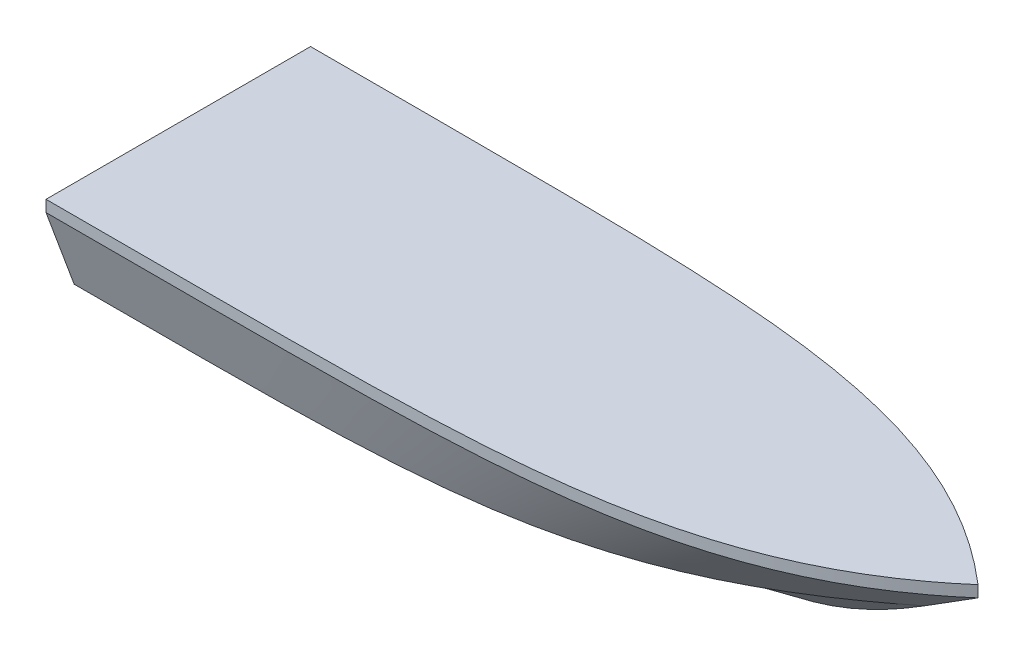
ISO-10303-21;
HEADER;
FILE_DESCRIPTION(('STEP AP214'),'2;1');
FILE_NAME('part.step','',(''),(''),'','','');
FILE_SCHEMA(('AUTOMOTIVE_DESIGN { 1 0 10303 214 1 1 1 1 }'));
ENDSEC;
DATA;
#1=APPLICATION_CONTEXT('core data for automotive mechanical design processes');
#2=APPLICATION_PROTOCOL_DEFINITION('international standard','automotive_design',2000,#1);
#3=PRODUCT_CONTEXT('',#1,'mechanical');
#4=PRODUCT('Part','Part','',(#3));
#5=PRODUCT_RELATED_PRODUCT_CATEGORY('part','',(#4));
#6=PRODUCT_DEFINITION_FORMATION('','',#4);
#7=PRODUCT_DEFINITION_CONTEXT('part definition',#1,'design');
#8=PRODUCT_DEFINITION('design','',#6,#7);
#9=PRODUCT_DEFINITION_SHAPE('','',#8);
#10=(LENGTH_UNIT() NAMED_UNIT(*) SI_UNIT(.MILLI.,.METRE.));
#11=(NAMED_UNIT(*) PLANE_ANGLE_UNIT() SI_UNIT($,.RADIAN.));
#12=(NAMED_UNIT(*) SI_UNIT($,.STERADIAN.) SOLID_ANGLE_UNIT());
#13=UNCERTAINTY_MEASURE_WITH_UNIT(LENGTH_MEASURE(1.E-05),#10,'distance_accuracy_value','');
#14=(GEOMETRIC_REPRESENTATION_CONTEXT(3) GLOBAL_UNCERTAINTY_ASSIGNED_CONTEXT((#13)) GLOBAL_UNIT_ASSIGNED_CONTEXT((#10,
#11,#12)) REPRESENTATION_CONTEXT('',''));
#15=CARTESIAN_POINT('',(0.,0.,0.));
#16=DIRECTION('',(0.,0.,1.));
#17=DIRECTION('',(1.,0.,0.));
#18=AXIS2_PLACEMENT_3D('',#15,#16,#17);
#19=CARTESIAN_POINT('',(3139.26827334746,1146.63157847919,146.348282725462));
#20=CARTESIAN_POINT('',(3318.28667634897,1146.63157847919,146.348282725462));
#21=CARTESIAN_POINT('',(3497.30507935048,1146.63157847919,146.348282725462));
#22=CARTESIAN_POINT('',(3676.32348235199,1146.63157847919,146.348282725462));
#23=CARTESIAN_POINT('',(3855.3418853535,1146.63157847919,146.348282725462));
#24=CARTESIAN_POINT('',(4023.95027334746,1146.63157847919,0.0213547819710433));
#25=B_SPLINE_CURVE_WITH_KNOTS('',5,(#19,#20,#21,#22,#23,#24),.UNSPECIFIED.,.F.,.F.,(6,6),(0.,
9710.49137354744),.UNSPECIFIED.);
#26=DIRECTION('',(0.,-1.,0.));
#27=VECTOR('',#26,1.);
#28=SURFACE_OF_LINEAR_EXTRUSION('',#25,#27);
#29=CARTESIAN_POINT('',(3139.26827334746,1133.93157847919,146.348282725462));
#30=CARTESIAN_POINT('',(3318.28667634897,1133.93157847919,146.348282725462));
#31=CARTESIAN_POINT('',(3497.30507935048,1133.93157847919,146.348282725462));
#32=CARTESIAN_POINT('',(3676.32348235199,1133.93157847919,146.348282725462));
#33=CARTESIAN_POINT('',(3855.3418853535,1133.93157847919,146.348282725462));
#34=CARTESIAN_POINT('',(4023.95027334746,1133.93157847919,0.0213547819710433));
#35=B_SPLINE_CURVE_WITH_KNOTS('',5,(#29,#30,#31,#32,#33,#34),.UNSPECIFIED.,.F.,.F.,(6,6),(0.,
9710.49137354744),.UNSPECIFIED.);
#36=CARTESIAN_POINT('',(3139.26827334746,1133.93157847919,146.348282725462));
#37=VERTEX_POINT('',#36);
#38=CARTESIAN_POINT('',(4023.95027334746,1133.93157847919,0.0213547819710433));
#39=VERTEX_POINT('',#38);
#40=EDGE_CURVE('E99',#37,#39,#35,.T.);
#41=ORIENTED_EDGE('',*,*,#40,.T.);
#42=DIRECTION('',(0.,-1.,0.));
#43=VECTOR('',#42,1.);
#44=CARTESIAN_POINT('',(4023.95027334746,1146.63157847919,0.0213547819710433));
#45=LINE('',#44,#43);
#46=CARTESIAN_POINT('',(4023.95027334746,1146.63157847919,0.0213547819710433));
#47=VERTEX_POINT('',#46);
#48=EDGE_CURVE('E12',#47,#39,#45,.T.);
#49=ORIENTED_EDGE('',*,*,#48,.F.);
#50=CARTESIAN_POINT('',(3139.26827334746,1146.63157847919,146.348282725462));
#51=VERTEX_POINT('',#50);
#52=EDGE_CURVE('E93',#51,#47,#25,.T.);
#53=ORIENTED_EDGE('',*,*,#52,.F.);
#54=DIRECTION('',(0.,-1.,0.));
#55=VECTOR('',#54,1.);
#56=CARTESIAN_POINT('',(3139.26827334746,1146.63157847919,146.348282725462));
#57=LINE('',#56,#55);
#58=EDGE_CURVE('E100',#51,#37,#57,.T.);
#59=ORIENTED_EDGE('',*,*,#58,.T.);
#60=EDGE_LOOP('',(#41,#49,#53,#59));
#61=FACE_BOUND('',#60,.T.);
#62=ADVANCED_FACE('F52',(#61),#28,.F.);
#63=CARTESIAN_POINT('',(4023.95027334746,1146.63157847919,0.0213547819710433));
#64=CARTESIAN_POINT('',(3855.3418853535,1146.63157847919,-146.30557316152));
#65=CARTESIAN_POINT('',(3676.32348235199,1146.63157847919,-146.30557316152));
#66=CARTESIAN_POINT('',(3497.30507935048,1146.63157847919,-146.30557316152));
#67=CARTESIAN_POINT('',(3318.28667634897,1146.63157847919,-146.30557316152));
#68=CARTESIAN_POINT('',(3139.26827334746,1146.63157847919,-146.30557316152));
#69=B_SPLINE_CURVE_WITH_KNOTS('',5,(#63,#64,#65,#66,#67,#68),.UNSPECIFIED.,.F.,.F.,(6,6),(0.,
9710.49137354744),.UNSPECIFIED.);
#70=DIRECTION('',(0.,-1.,0.));
#71=VECTOR('',#70,1.);
#72=SURFACE_OF_LINEAR_EXTRUSION('',#69,#71);
#73=CARTESIAN_POINT('',(4023.95027334746,1133.93157847919,0.0213547819710433));
#74=CARTESIAN_POINT('',(3855.3418853535,1133.93157847919,-146.30557316152));
#75=CARTESIAN_POINT('',(3676.32348235199,1133.93157847919,-146.30557316152));
#76=CARTESIAN_POINT('',(3497.30507935048,1133.93157847919,-146.30557316152));
#77=CARTESIAN_POINT('',(3318.28667634897,1133.93157847919,-146.30557316152));
#78=CARTESIAN_POINT('',(3139.26827334746,1133.93157847919,-146.30557316152));
#79=B_SPLINE_CURVE_WITH_KNOTS('',5,(#73,#74,#75,#76,#77,#78),.UNSPECIFIED.,.F.,.F.,(6,6),(0.,
9710.49137354744),.UNSPECIFIED.);
#80=CARTESIAN_POINT('',(3139.26827334746,1133.93157847919,-146.30557316152));
#81=VERTEX_POINT('',#80);
#82=EDGE_CURVE('E81',#39,#81,#79,.T.);
#83=ORIENTED_EDGE('',*,*,#82,.T.);
#84=DIRECTION('',(0.,-1.,0.));
#85=VECTOR('',#84,1.);
#86=CARTESIAN_POINT('',(3139.26827334746,1146.63157847919,-146.30557316152));
#87=LINE('',#86,#85);
#88=CARTESIAN_POINT('',(3139.26827334746,1146.63157847919,-146.30557316152));
#89=VERTEX_POINT('',#88);
#90=EDGE_CURVE('E61',#89,#81,#87,.T.);
#91=ORIENTED_EDGE('',*,*,#90,.F.);
#92=EDGE_CURVE('E89',#47,#89,#69,.T.);
#93=ORIENTED_EDGE('',*,*,#92,.F.);
#94=ORIENTED_EDGE('',*,*,#48,.T.);
#95=EDGE_LOOP('',(#83,#91,#93,#94));
#96=FACE_BOUND('',#95,.T.);
#97=ADVANCED_FACE('F90',(#96),#72,.F.);
#98=CARTESIAN_POINT('',(3139.26827334746,1146.63157847919,-146.30557316152));
#99=DIRECTION('',(1.,0.,0.));
#100=DIRECTION('',(0.,0.,-1.));
#101=AXIS2_PLACEMENT_3D('',#98,#99,#100);
#102=PLANE('',#101);
#103=DIRECTION('',(0.,0.,1.));
#104=VECTOR('',#103,1.);
#105=CARTESIAN_POINT('',(3139.26827334746,1133.93157847919,-146.30557316152));
#106=LINE('',#105,#104);
#107=EDGE_CURVE('E86',#81,#37,#106,.T.);
#108=ORIENTED_EDGE('',*,*,#107,.T.);
#109=ORIENTED_EDGE('',*,*,#58,.F.);
#110=DIRECTION('',(0.,0.,1.));
#111=VECTOR('',#110,1.);
#112=CARTESIAN_POINT('',(3139.26827334746,1146.63157847919,-146.30557316152));
#113=LINE('',#112,#111);
#114=EDGE_CURVE('E69',#89,#51,#113,.T.);
#115=ORIENTED_EDGE('',*,*,#114,.F.);
#116=ORIENTED_EDGE('',*,*,#90,.T.);
#117=EDGE_LOOP('',(#108,#109,#115,#116));
#118=FACE_BOUND('',#117,.T.);
#119=ADVANCED_FACE('F117',(#118),#102,.F.);
#120=CARTESIAN_POINT('',(3586.48896788225,1146.63157847919,141.775566227228));
#121=DIRECTION('',(0.,-1.,0.));
#122=DIRECTION('',(0.,0.,-1.));
#123=AXIS2_PLACEMENT_3D('',#120,#121,#122);
#124=PLANE('',#123);
#125=ORIENTED_EDGE('',*,*,#52,.T.);
#126=ORIENTED_EDGE('',*,*,#92,.T.);
#127=ORIENTED_EDGE('',*,*,#114,.T.);
#128=EDGE_LOOP('',(#125,#126,#127));
#129=FACE_BOUND('',#128,.T.);
#130=ADVANCED_FACE('F96',(#129),#124,.F.);
#131=CARTESIAN_POINT('',(3586.48896788225,1133.93157847919,141.775566227228));
#132=DIRECTION('',(0.,-1.,0.));
#133=DIRECTION('',(0.,0.,-1.));
#134=AXIS2_PLACEMENT_3D('',#131,#132,#133);
#135=PLANE('',#134);
#136=ORIENTED_EDGE('',*,*,#40,.F.);
#137=ORIENTED_EDGE('',*,*,#107,.F.);
#138=ORIENTED_EDGE('',*,*,#82,.F.);
#139=EDGE_LOOP('',(#136,#137,#138));
#140=FACE_BOUND('',#139,.T.);
#141=ADVANCED_FACE('F118',(#140),#135,.T.);
#142=CLOSED_SHELL('',(#62,#97,#119,#130,#141));
#143=MANIFOLD_SOLID_BREP('B2',#142);
#144=CARTESIAN_POINT('',(3139.26827334746,1022.4108319476,1.04505078197104));
#145=CARTESIAN_POINT('',(3139.26827334746,1022.68077847919,0.0213547819710433));
#146=CARTESIAN_POINT('',(3139.26827334746,1049.67543163806,-102.348245218029));
#147=CARTESIAN_POINT('',(3673.83207873831,1022.4108319476,1.04505078197104));
#148=CARTESIAN_POINT('',(3670.07747334746,1022.68077847919,0.0213547819710433));
#149=CARTESIAN_POINT('',(3294.61693426274,1049.67543163806,-102.348245218029));
#150=CARTESIAN_POINT('',(3731.84718012916,1022.4108319476,1.04505078197104));
#151=CARTESIAN_POINT('',(3729.05627334747,1022.68077847919,0.0213547819710433));
#152=CARTESIAN_POINT('',(3449.96559517802,1049.67543163806,-102.348245218029));
#153=CARTESIAN_POINT('',(3789.86228152,1022.4108319476,1.04505078197104));
#154=CARTESIAN_POINT('',(3788.03507334746,1022.68077847919,0.0213547819710433));
#155=CARTESIAN_POINT('',(3605.3142560933,1049.67543163806,-102.348245218029));
#156=CARTESIAN_POINT('',(3847.87738291085,1022.20707704899,1.04505078197104));
#157=CARTESIAN_POINT('',(3847.01387334747,1022.68077847919,0.0213547819710433));
#158=CARTESIAN_POINT('',(3760.66291700858,1070.05092149943,-102.348245218029));
#159=CARTESIAN_POINT('',(3964.97147334747,1096.84797847919,0.0213547819710433));
#160=CARTESIAN_POINT('',(3964.97147334747,1096.84797847919,0.0213547819710433));
#161=CARTESIAN_POINT('',(3964.97147334747,1096.84797847919,0.0213547819710433));
#162=B_SPLINE_SURFACE_WITH_KNOTS('',5,1,((#144,#145,#146),(#147,#148,#149),(#150,#151,#152),
(#153,#154,#155),(#156,#157,#158),(#159,#160,#161)),.UNSPECIFIED.,.F.,.F.,.F.,(6,6),(2,1,2),(0.,
8897.05627484771),(-12.7701332697109,0.,1277.01332697109),.UNSPECIFIED.);
#163=CARTESIAN_POINT('',(3215.46827334746,1029.37870628423,-25.3784536332029));
#164=CARTESIAN_POINT('',(3215.46827334746,1027.14606427228,-16.9118506726331));
#165=CARTESIAN_POINT('',(3215.46827334746,1024.91342226033,-8.44524771206329));
#166=CARTESIAN_POINT('',(3215.46827334746,1022.68078024839,0.0213552485065236));
#167=B_SPLINE_CURVE_WITH_KNOTS('',3,(#163,#164,#165,#166),.UNSPECIFIED.,.F.,.F.,(4,4),(0.,
26.2680890894068),.UNSPECIFIED.);
#168=CARTESIAN_POINT('',(3215.46827334747,1029.37865904841,-25.3784660893597));
#169=VERTEX_POINT('',#168);
#170=CARTESIAN_POINT('',(3215.46827334747,1022.68078024839,0.0213547819710485));
#171=VERTEX_POINT('',#170);
#172=EDGE_CURVE('E198',#169,#171,#167,.T.);
#173=CARTESIAN_POINT('',(3215.46827334733,1029.37875352069,-25.3786327617152));
#174=CARTESIAN_POINT('',(3212.45799471826,1029.37874514425,-25.3786335751318));
#175=CARTESIAN_POINT('',(3209.44771608918,1029.37873841474,-25.378634296887));
#176=CARTESIAN_POINT('',(3203.38142764437,1029.37872739207,-25.3786356185838));
#177=CARTESIAN_POINT('',(3200.32541782865,1029.37872313748,-25.3786362165081));
#178=CARTESIAN_POINT('',(3194.16700883229,1029.37871636365,-25.3786373389299));
#179=CARTESIAN_POINT('',(3191.06460965165,1029.37871387172,-25.378637862175));
#180=CARTESIAN_POINT('',(3184.8127574926,1029.37871008365,-25.3786388657521));
#181=CARTESIAN_POINT('',(3181.66330451419,1029.37870880621,-25.378639345313));
#182=CARTESIAN_POINT('',(3175.31667403759,1029.37870700142,-25.378640282987));
#183=CARTESIAN_POINT('',(3172.1194965394,1029.37870648573,-25.378640740665));
#184=CARTESIAN_POINT('',(3165.67673997742,1029.37870586893,-25.3786416472027));
#185=CARTESIAN_POINT('',(3162.43116091363,1029.37870577423,-25.3786420958239));
#186=CARTESIAN_POINT('',(3155.89091781627,1029.37870575674,-25.3786429908437));
#187=CARTESIAN_POINT('',(3152.5962537827,1029.37870583658,-25.3786434371061));
#188=CARTESIAN_POINT('',(3145.95715094857,1029.37870605102,-25.3786443291891));
#189=CARTESIAN_POINT('',(3142.61271214802,1029.37870618642,-25.3786447749012));
#190=CARTESIAN_POINT('',(3139.26827334746,1029.37870628427,-25.3786452180289));
#191=B_SPLINE_CURVE_WITH_KNOTS('',3,(#173,#174,#175,#176,#177,#178,#179,#180,#181,#182,#183,
#184,#185,#186,#187,#188,#189,#190),.UNSPECIFIED.,.F.,.F.,(4,2,2,2,2,2,2,2,4),(0.,
9.03083588726056,18.1988653344365,27.5060628763634,36.9544218115831,46.5459543061633,
56.2826914975235,66.1666835982499,76.1999999999051),.UNSPECIFIED.);
#192=CARTESIAN_POINT('',(3139.26827334746,1029.37870628427,-25.3786452180289));
#193=VERTEX_POINT('',#192);
#194=EDGE_CURVE('E50',#169,#193,#191,.T.);
#195=DIRECTION('',(0.,-0.254981645082517,0.96694589335237));
#196=VECTOR('',#195,1.);
#197=CARTESIAN_POINT('',(3139.26827334746,1049.67543163806,-102.348245218029));
#198=LINE('',#197,#196);
#199=CARTESIAN_POINT('',(3139.26827334746,1049.67543163806,-102.348245218029));
#200=VERTEX_POINT('',#199);
#201=EDGE_CURVE('E259',#200,#193,#198,.T.);
#202=CARTESIAN_POINT('',(3139.26827334746,1049.67543163806,-102.348245218029));
#203=CARTESIAN_POINT('',(3294.61693426274,1049.67543163806,-102.348245218029));
#204=CARTESIAN_POINT('',(3449.96559517802,1049.67543163806,-102.348245218029));
#205=CARTESIAN_POINT('',(3605.3142560933,1049.67543163806,-102.348245218029));
#206=CARTESIAN_POINT('',(3760.66291700858,1070.05092149943,-102.348245218029));
#207=CARTESIAN_POINT('',(3964.97147334747,1096.84797847919,0.0213547819710433));
#208=B_SPLINE_CURVE_WITH_KNOTS('',5,(#202,#203,#204,#205,#206,#207),.UNSPECIFIED.,.F.,.F.,(6,6),
(0.,8897.05627484771),.UNSPECIFIED.);
#209=CARTESIAN_POINT('',(3964.97147334747,1096.84797847919,0.0213547819710433));
#210=VERTEX_POINT('',#209);
#211=EDGE_CURVE('E249',#210,#200,#208,.F.);
#212=CARTESIAN_POINT('',(3139.26827334746,1022.68077847919,0.0213547819710433));
#213=CARTESIAN_POINT('',(3670.07747334746,1022.68077847919,0.0213547819710433));
#214=CARTESIAN_POINT('',(3729.05627334747,1022.68077847919,0.0213547819710433));
#215=CARTESIAN_POINT('',(3788.03507334746,1022.68077847919,0.0213547819710433));
#216=CARTESIAN_POINT('',(3847.01387334747,1022.68077847919,0.0213547819710433));
#217=CARTESIAN_POINT('',(3964.97147334747,1096.84797847919,0.0213547819710433));
#218=B_SPLINE_CURVE_WITH_KNOTS('',5,(#212,#213,#214,#215,#216,#217),.UNSPECIFIED.,.F.,.F.,(6,6),
(0.,8897.05627484771),.UNSPECIFIED.);
#219=EDGE_CURVE('E265',#171,#210,#218,.T.);
#220=ORIENTED_EDGE('',*,*,#172,.F.);
#221=ORIENTED_EDGE('',*,*,#194,.T.);
#222=ORIENTED_EDGE('',*,*,#201,.F.);
#223=ORIENTED_EDGE('',*,*,#211,.F.);
#224=ORIENTED_EDGE('',*,*,#219,.F.);
#225=EDGE_LOOP('',(#220,#221,#222,#223,#224));
#226=FACE_BOUND('',#225,.T.);
#227=ADVANCED_FACE('F181',(#226),#162,.F.);
#228=CARTESIAN_POINT('',(3139.26827334746,1022.68077847919,0.0213547819710433));
#229=DIRECTION('',(1.,0.,0.));
#230=DIRECTION('',(0.,0.,-1.));
#231=AXIS2_PLACEMENT_3D('',#228,#229,#230);
#232=PLANE('',#231);
#233=DIRECTION('',(0.,0.,1.));
#234=VECTOR('',#233,1.);
#235=CARTESIAN_POINT('',(3139.26827334746,1029.37870628427,-25.3786452180289));
#236=LINE('',#235,#234);
#237=CARTESIAN_POINT('',(3139.26827334746,1029.37870628427,25.4213547819711));
#238=VERTEX_POINT('',#237);
#239=EDGE_CURVE('E244',#193,#238,#236,.T.);
#240=ORIENTED_EDGE('',*,*,#239,.T.);
#241=DIRECTION('',(0.,-0.254981645082517,-0.96694589335237));
#242=VECTOR('',#241,1.);
#243=CARTESIAN_POINT('',(3139.26827334746,1049.67543163806,102.390954781971));
#244=LINE('',#243,#242);
#245=CARTESIAN_POINT('',(3139.26827334746,1049.67543163806,102.390954781971));
#246=VERTEX_POINT('',#245);
#247=EDGE_CURVE('E256',#246,#238,#244,.T.);
#248=ORIENTED_EDGE('',*,*,#247,.F.);
#249=DIRECTION('',(0.,0.,-1.));
#250=VECTOR('',#249,1.);
#251=CARTESIAN_POINT('',(3139.26827334746,1049.67543163806,115.187154781971));
#252=LINE('',#251,#250);
#253=CARTESIAN_POINT('',(3139.26827334746,1049.67543163806,115.187154781971));
#254=VERTEX_POINT('',#253);
#255=EDGE_CURVE('E291',#254,#246,#252,.T.);
#256=ORIENTED_EDGE('',*,*,#255,.F.);
#257=DIRECTION('',(0.,-0.937911270757067,-0.346875263152137));
#258=VECTOR('',#257,1.);
#259=CARTESIAN_POINT('',(3139.26827334746,1091.80350505862,130.767718753716));
#260=LINE('',#259,#258);
#261=CARTESIAN_POINT('',(3139.26827334746,1133.93157847919,146.348282725462));
#262=VERTEX_POINT('',#261);
#263=EDGE_CURVE('E301',#262,#254,#260,.T.);
#264=ORIENTED_EDGE('',*,*,#263,.F.);
#265=DIRECTION('',(0.,0.,1.));
#266=VECTOR('',#265,1.);
#267=CARTESIAN_POINT('',(3139.26827334746,1133.93157847919,0.0213547819710433));
#268=LINE('',#267,#266);
#269=CARTESIAN_POINT('',(3139.26827334746,1133.93157847919,-146.30557316152));
#270=VERTEX_POINT('',#269);
#271=EDGE_CURVE('E310',#270,#262,#268,.T.);
#272=ORIENTED_EDGE('',*,*,#271,.F.);
#273=DIRECTION('',(0.,-0.937911270757067,0.346875263152137));
#274=VECTOR('',#273,1.);
#275=CARTESIAN_POINT('',(3139.26827334746,1091.80350505862,-130.725009189774));
#276=LINE('',#275,#274);
#277=CARTESIAN_POINT('',(3139.26827334746,1049.67543163806,-115.144445218029));
#278=VERTEX_POINT('',#277);
#279=EDGE_CURVE('E269',#270,#278,#276,.T.);
#280=ORIENTED_EDGE('',*,*,#279,.T.);
#281=DIRECTION('',(0.,0.,1.));
#282=VECTOR('',#281,1.);
#283=CARTESIAN_POINT('',(3139.26827334746,1049.67543163806,-115.144445218029));
#284=LINE('',#283,#282);
#285=EDGE_CURVE('E314',#278,#200,#284,.T.);
#286=ORIENTED_EDGE('',*,*,#285,.T.);
#287=ORIENTED_EDGE('',*,*,#201,.T.);
#288=EDGE_LOOP('',(#240,#248,#256,#264,#272,#280,#286,#287));
#289=FACE_BOUND('',#288,.T.);
#290=ADVANCED_FACE('F255',(#289),#232,.F.);
#291=CARTESIAN_POINT('',(3139.26827334746,1022.68077847919,0.0213547819710433));
#292=CARTESIAN_POINT('',(3139.26827334746,1049.67543163806,102.390954781971));
#293=CARTESIAN_POINT('',(3670.07747334746,1022.68077847919,0.0213547819710433));
#294=CARTESIAN_POINT('',(3294.61693426274,1049.67543163806,102.390954781971));
#295=CARTESIAN_POINT('',(3729.05627334747,1022.68077847919,0.0213547819710433));
#296=CARTESIAN_POINT('',(3449.96559517802,1049.67543163806,102.390954781971));
#297=CARTESIAN_POINT('',(3788.03507334746,1022.68077847919,0.0213547819710433));
#298=CARTESIAN_POINT('',(3605.3142560933,1049.67543163806,102.390954781971));
#299=CARTESIAN_POINT('',(3847.01387334747,1022.68077847919,0.0213547819710433));
#300=CARTESIAN_POINT('',(3760.66291700858,1070.05092149943,102.390954781971));
#301=CARTESIAN_POINT('',(3964.97147334747,1096.84797847919,0.0213547819710433));
#302=CARTESIAN_POINT('',(3964.97147334747,1096.84797847919,0.0213547819710433));
#303=B_SPLINE_SURFACE_WITH_KNOTS('',5,1,((#291,#292),(#293,#294),(#295,#296),(#297,#298),(#299,
#300),(#301,#302)),.UNSPECIFIED.,.F.,.F.,.F.,(6,6),(2,2),(0.,8897.05627484771),(0.,
1277.01332697109),.UNSPECIFIED.);
#304=CARTESIAN_POINT('',(3139.26827334746,1029.37870628427,25.4213547819711));
#305=CARTESIAN_POINT('',(3142.61271214802,1029.37870618642,25.4213543388434));
#306=CARTESIAN_POINT('',(3145.95715094857,1029.37870605102,25.4213538931313));
#307=CARTESIAN_POINT('',(3152.5962537827,1029.37870583658,25.4213530010483));
#308=CARTESIAN_POINT('',(3155.89091781627,1029.37870575674,25.4213525547858));
#309=CARTESIAN_POINT('',(3162.43116091363,1029.37870577423,25.421351659766));
#310=CARTESIAN_POINT('',(3165.67673997742,1029.37870586894,25.4213512111448));
#311=CARTESIAN_POINT('',(3172.1194965394,1029.37870648573,25.4213503046071));
#312=CARTESIAN_POINT('',(3175.31667403759,1029.37870700142,25.4213498469291));
#313=CARTESIAN_POINT('',(3181.66330451419,1029.37870880621,25.421348909255));
#314=CARTESIAN_POINT('',(3184.8127574926,1029.37871008365,25.4213484296942));
#315=CARTESIAN_POINT('',(3191.06460965165,1029.37871387172,25.421347426117));
#316=CARTESIAN_POINT('',(3194.16700883229,1029.37871636365,25.4213469028719));
#317=CARTESIAN_POINT('',(3200.32541782865,1029.37872313748,25.4213457804501));
#318=CARTESIAN_POINT('',(3203.38142764438,1029.37872739207,25.4213451825258));
#319=CARTESIAN_POINT('',(3209.44771608918,1029.37873841474,25.4213438608291));
#320=CARTESIAN_POINT('',(3212.45799471826,1029.37874514425,25.4213431390738));
#321=CARTESIAN_POINT('',(3215.46827334733,1029.37875352069,25.4213423256572));
#322=B_SPLINE_CURVE_WITH_KNOTS('',3,(#304,#305,#306,#307,#308,#309,#310,#311,#312,#313,#314,
#315,#316,#317,#318,#319,#320,#321),.UNSPECIFIED.,.F.,.F.,(4,2,2,2,2,2,2,2,4),(0.,
10.0333164016565,19.9173085023802,29.6540456937418,39.2455781883215,48.6939371235408,
58.001134665469,67.1691641126459,76.1999999999042),.UNSPECIFIED.);
#323=CARTESIAN_POINT('',(3215.46827334741,1029.3787123403,25.4212819545029));
#324=VERTEX_POINT('',#323);
#325=EDGE_CURVE('E240',#324,#238,#322,.F.);
#326=CARTESIAN_POINT('',(3215.46827334746,1029.37873595836,25.4212757263852));
#327=CARTESIAN_POINT('',(3215.46827334746,1027.14608405503,16.9546352560687));
#328=CARTESIAN_POINT('',(3215.46827334746,1024.91343215171,8.48799478575223));
#329=CARTESIAN_POINT('',(3215.46827334746,1022.68078024839,0.021354315435727));
#330=B_SPLINE_CURVE_WITH_KNOTS('',3,(#326,#327,#328,#329),.UNSPECIFIED.,.F.,.F.,(4,4),(0.,
26.2682054654516),.UNSPECIFIED.);
#331=EDGE_CURVE('E250',#324,#171,#330,.T.);
#332=CARTESIAN_POINT('',(3139.26827334746,1049.67543163806,102.390954781971));
#333=CARTESIAN_POINT('',(3294.61693426274,1049.67543163806,102.390954781971));
#334=CARTESIAN_POINT('',(3449.96559517802,1049.67543163806,102.390954781971));
#335=CARTESIAN_POINT('',(3605.3142560933,1049.67543163806,102.390954781971));
#336=CARTESIAN_POINT('',(3760.66291700858,1070.05092149943,102.390954781971));
#337=CARTESIAN_POINT('',(3964.97147334747,1096.84797847919,0.0213547819710433));
#338=B_SPLINE_CURVE_WITH_KNOTS('',5,(#332,#333,#334,#335,#336,#337),.UNSPECIFIED.,.F.,.F.,(6,6),
(0.,8897.05627484771),.UNSPECIFIED.);
#339=EDGE_CURVE('E264',#210,#246,#338,.F.);
#340=ORIENTED_EDGE('',*,*,#325,.F.);
#341=ORIENTED_EDGE('',*,*,#331,.T.);
#342=ORIENTED_EDGE('',*,*,#219,.T.);
#343=ORIENTED_EDGE('',*,*,#339,.T.);
#344=ORIENTED_EDGE('',*,*,#247,.T.);
#345=EDGE_LOOP('',(#340,#341,#342,#343,#344));
#346=FACE_BOUND('',#345,.T.);
#347=ADVANCED_FACE('F262',(#346),#303,.T.);
#348=CARTESIAN_POINT('',(3139.26827334746,1049.67543163806,102.390954781971));
#349=CARTESIAN_POINT('',(3139.26827334746,1049.67543163806,115.187154781971));
#350=CARTESIAN_POINT('',(3294.61693426274,1049.67543163806,102.390954781971));
#351=CARTESIAN_POINT('',(3294.61693426274,1049.67543163806,115.187154781971));
#352=CARTESIAN_POINT('',(3449.96559517802,1049.67543163806,102.390954781971));
#353=CARTESIAN_POINT('',(3449.96559517802,1049.67543163806,115.187154781971));
#354=CARTESIAN_POINT('',(3605.3142560933,1049.67543163806,102.390954781971));
#355=CARTESIAN_POINT('',(3605.3142560933,1049.67543163806,115.187154781971));
#356=CARTESIAN_POINT('',(3760.66291700858,1070.05092149943,102.390954781971));
#357=CARTESIAN_POINT('',(3760.66291700858,1070.05092149943,115.187154781971));
#358=CARTESIAN_POINT('',(3964.97147334747,1096.84797847919,0.0213547819710433));
#359=CARTESIAN_POINT('',(3964.97147334747,1096.84797847919,0.0213547819710433));
#360=B_SPLINE_SURFACE_WITH_KNOTS('',5,1,((#348,#349),(#350,#351),(#352,#353),(#354,#355),(#356,
#357),(#358,#359)),.UNSPECIFIED.,.F.,.F.,.F.,(6,6),(2,2),(0.,8794.40554991982),(0.,150.),.UNSPECIFIED.);
#361=CARTESIAN_POINT('',(3139.26827334746,1049.67543163806,115.187154781971));
#362=CARTESIAN_POINT('',(3294.61693426274,1049.67543163806,115.187154781971));
#363=CARTESIAN_POINT('',(3449.96559517802,1049.67543163806,115.187154781971));
#364=CARTESIAN_POINT('',(3605.3142560933,1049.67543163806,115.187154781971));
#365=CARTESIAN_POINT('',(3760.66291700858,1070.05092149943,115.187154781971));
#366=CARTESIAN_POINT('',(3964.97147334747,1096.84797847919,0.0213547819710433));
#367=B_SPLINE_CURVE_WITH_KNOTS('',5,(#361,#362,#363,#364,#365,#366),.UNSPECIFIED.,.F.,.F.,(6,6),
(0.,8794.40554991982),.UNSPECIFIED.);
#368=EDGE_CURVE('E267',#210,#254,#367,.F.);
#369=ORIENTED_EDGE('',*,*,#368,.T.);
#370=ORIENTED_EDGE('',*,*,#255,.T.);
#371=ORIENTED_EDGE('',*,*,#339,.F.);
#372=EDGE_LOOP('',(#369,#370,#371));
#373=FACE_BOUND('',#372,.T.);
#374=ADVANCED_FACE('F361',(#373),#360,.T.);
#375=CARTESIAN_POINT('',(3139.26827334746,1049.67543163806,115.187154781971));
#376=CARTESIAN_POINT('',(3139.26827334746,1091.80350505862,130.767718753716));
#377=CARTESIAN_POINT('',(3139.26827334746,1133.93157847919,146.348282725462));
#378=CARTESIAN_POINT('',(3294.61693426274,1049.67543163806,115.187154781971));
#379=CARTESIAN_POINT('',(3306.45180530586,1091.80350505862,130.767718753716));
#380=CARTESIAN_POINT('',(3318.28667634897,1133.93157847919,146.348282725462));
#381=CARTESIAN_POINT('',(3449.96559517802,1049.67543163806,115.187154781971));
#382=CARTESIAN_POINT('',(3473.63533726425,1091.80350505862,130.767718753717));
#383=CARTESIAN_POINT('',(3497.30507935048,1133.93157847919,146.348282725462));
#384=CARTESIAN_POINT('',(3605.3142560933,1049.67543163806,115.187154781971));
#385=CARTESIAN_POINT('',(3640.81886922265,1091.80350505862,130.767718753716));
#386=CARTESIAN_POINT('',(3676.32348235199,1133.93157847919,146.348282725462));
#387=CARTESIAN_POINT('',(3760.66291700858,1070.05092149943,115.187154781971));
#388=CARTESIAN_POINT('',(3808.00240118104,1101.99124998931,130.767718753717));
#389=CARTESIAN_POINT('',(3855.3418853535,1133.93157847919,146.348282725462));
#390=CARTESIAN_POINT('',(3964.97147334747,1096.84797847919,0.0213547819710433));
#391=CARTESIAN_POINT('',(3994.46087334746,1115.38977847919,0.0213547819710433));
#392=CARTESIAN_POINT('',(4023.95027334746,1133.93157847919,0.0213547819710433));
#393=B_SPLINE_SURFACE_WITH_KNOTS('',5,2,((#375,#376,#377),(#378,#379,#380),(#381,#382,#383),
(#384,#385,#386),(#387,#388,#389),(#390,#391,#392)),.UNSPECIFIED.,.F.,.F.,.F.,(6,6),(3,3),(0.,
9710.49137354744),(0.,1411.32546804126),.UNSPECIFIED.);
#394=CARTESIAN_POINT('',(3139.26827334746,1133.93157847919,146.348282725462));
#395=CARTESIAN_POINT('',(3318.28667634897,1133.93157847919,146.348282725462));
#396=CARTESIAN_POINT('',(3497.30507935048,1133.93157847919,146.348282725462));
#397=CARTESIAN_POINT('',(3676.32348235199,1133.93157847919,146.348282725462));
#398=CARTESIAN_POINT('',(3855.3418853535,1133.93157847919,146.348282725462));
#399=CARTESIAN_POINT('',(4023.95027334746,1133.93157847919,0.0213547819710433));
#400=B_SPLINE_CURVE_WITH_KNOTS('',5,(#394,#395,#396,#397,#398,#399),.UNSPECIFIED.,.F.,.F.,(6,6),
(0.,9710.49137354744),.UNSPECIFIED.);
#401=CARTESIAN_POINT('',(4023.95027334746,1133.93157847919,0.0213547819710433));
#402=VERTEX_POINT('',#401);
#403=EDGE_CURVE('E296',#402,#262,#400,.F.);
#404=DIRECTION('',(0.846564035427738,0.532286890614735,0.));
#405=VECTOR('',#404,1.);
#406=CARTESIAN_POINT('',(3994.46087334746,1115.38977847919,0.0213547819710433));
#407=LINE('',#406,#405);
#408=EDGE_CURVE('E307',#210,#402,#407,.T.);
#409=ORIENTED_EDGE('',*,*,#403,.T.);
#410=ORIENTED_EDGE('',*,*,#263,.T.);
#411=ORIENTED_EDGE('',*,*,#368,.F.);
#412=ORIENTED_EDGE('',*,*,#408,.T.);
#413=EDGE_LOOP('',(#409,#410,#411,#412));
#414=FACE_BOUND('',#413,.T.);
#415=ADVANCED_FACE('F412',(#414),#393,.T.);
#416=CARTESIAN_POINT('',(4023.95037164546,1133.93157847919,0.0213547819710433));
#417=DIRECTION('',(0.,-1.,0.));
#418=DIRECTION('',(0.,0.,-1.));
#419=AXIS2_PLACEMENT_3D('',#416,#417,#418);
#420=PLANE('',#419);
#421=ORIENTED_EDGE('',*,*,#403,.F.);
#422=CARTESIAN_POINT('',(3139.26827334746,1133.93157847919,-146.30557316152));
#423=CARTESIAN_POINT('',(3318.28667634897,1133.93157847919,-146.30557316152));
#424=CARTESIAN_POINT('',(3497.30507935048,1133.93157847919,-146.30557316152));
#425=CARTESIAN_POINT('',(3676.32348235199,1133.93157847919,-146.30557316152));
#426=CARTESIAN_POINT('',(3855.3418853535,1133.93157847919,-146.30557316152));
#427=CARTESIAN_POINT('',(4023.95027334746,1133.93157847919,0.0213547819710433));
#428=B_SPLINE_CURVE_WITH_KNOTS('',5,(#422,#423,#424,#425,#426,#427),.UNSPECIFIED.,.F.,.F.,(6,6),
(0.,9710.49137354744),.UNSPECIFIED.);
#429=EDGE_CURVE('E313',#402,#270,#428,.F.);
#430=ORIENTED_EDGE('',*,*,#429,.T.);
#431=ORIENTED_EDGE('',*,*,#271,.T.);
#432=EDGE_LOOP('',(#421,#430,#431));
#433=FACE_BOUND('',#432,.T.);
#434=ADVANCED_FACE('F389',(#433),#420,.F.);
#435=CARTESIAN_POINT('',(3139.26827334746,1049.67543163806,-102.348245218029));
#436=CARTESIAN_POINT('',(3139.26827334746,1049.67543163806,-115.144445218029));
#437=CARTESIAN_POINT('',(3294.61693426274,1049.67543163806,-102.348245218029));
#438=CARTESIAN_POINT('',(3294.61693426274,1049.67543163806,-115.144445218029));
#439=CARTESIAN_POINT('',(3449.96559517802,1049.67543163806,-102.348245218029));
#440=CARTESIAN_POINT('',(3449.96559517802,1049.67543163806,-115.144445218029));
#441=CARTESIAN_POINT('',(3605.3142560933,1049.67543163806,-102.348245218029));
#442=CARTESIAN_POINT('',(3605.3142560933,1049.67543163806,-115.144445218029));
#443=CARTESIAN_POINT('',(3760.66291700858,1070.05092149943,-102.348245218029));
#444=CARTESIAN_POINT('',(3760.66291700858,1070.05092149943,-115.144445218029));
#445=CARTESIAN_POINT('',(3964.97147334747,1096.84797847919,0.0213547819710433));
#446=CARTESIAN_POINT('',(3964.97147334747,1096.84797847919,0.0213547819710433));
#447=B_SPLINE_SURFACE_WITH_KNOTS('',5,1,((#435,#436),(#437,#438),(#439,#440),(#441,#442),(#443,
#444),(#445,#446)),.UNSPECIFIED.,.F.,.F.,.F.,(6,6),(2,2),(0.,8794.40554991982),(0.,150.),.UNSPECIFIED.);
#448=CARTESIAN_POINT('',(3139.26827334746,1049.67543163806,-115.144445218029));
#449=CARTESIAN_POINT('',(3294.61693426274,1049.67543163806,-115.144445218029));
#450=CARTESIAN_POINT('',(3449.96559517802,1049.67543163806,-115.144445218029));
#451=CARTESIAN_POINT('',(3605.3142560933,1049.67543163806,-115.144445218029));
#452=CARTESIAN_POINT('',(3760.66291700858,1070.05092149943,-115.144445218029));
#453=CARTESIAN_POINT('',(3964.97147334747,1096.84797847919,0.0213547819710433));
#454=B_SPLINE_CURVE_WITH_KNOTS('',5,(#448,#449,#450,#451,#452,#453),.UNSPECIFIED.,.F.,.F.,(6,6),
(0.,8794.40554991982),.UNSPECIFIED.);
#455=EDGE_CURVE('E316',#210,#278,#454,.F.);
#456=ORIENTED_EDGE('',*,*,#455,.F.);
#457=ORIENTED_EDGE('',*,*,#211,.T.);
#458=ORIENTED_EDGE('',*,*,#285,.F.);
#459=EDGE_LOOP('',(#456,#457,#458));
#460=FACE_BOUND('',#459,.T.);
#461=ADVANCED_FACE('F391',(#460),#447,.F.);
#462=CARTESIAN_POINT('',(3139.26827334746,1049.67543163806,-115.144445218029));
#463=CARTESIAN_POINT('',(3139.26827334746,1091.80350505862,-130.725009189774));
#464=CARTESIAN_POINT('',(3139.26827334746,1133.93157847919,-146.30557316152));
#465=CARTESIAN_POINT('',(3294.61693426274,1049.67543163806,-115.144445218029));
#466=CARTESIAN_POINT('',(3306.45180530586,1091.80350505862,-130.725009189774));
#467=CARTESIAN_POINT('',(3318.28667634897,1133.93157847919,-146.30557316152));
#468=CARTESIAN_POINT('',(3449.96559517802,1049.67543163806,-115.144445218029));
#469=CARTESIAN_POINT('',(3473.63533726425,1091.80350505862,-130.725009189774));
#470=CARTESIAN_POINT('',(3497.30507935048,1133.93157847919,-146.30557316152));
#471=CARTESIAN_POINT('',(3605.3142560933,1049.67543163806,-115.144445218029));
#472=CARTESIAN_POINT('',(3640.81886922265,1091.80350505862,-130.725009189774));
#473=CARTESIAN_POINT('',(3676.32348235199,1133.93157847919,-146.30557316152));
#474=CARTESIAN_POINT('',(3760.66291700858,1070.05092149943,-115.144445218029));
#475=CARTESIAN_POINT('',(3808.00240118104,1101.99124998931,-130.725009189775));
#476=CARTESIAN_POINT('',(3855.3418853535,1133.93157847919,-146.30557316152));
#477=CARTESIAN_POINT('',(3964.97147334747,1096.84797847919,0.0213547819710433));
#478=CARTESIAN_POINT('',(3994.46087334746,1115.38977847919,0.0213547819710433));
#479=CARTESIAN_POINT('',(4023.95027334746,1133.93157847919,0.0213547819710433));
#480=B_SPLINE_SURFACE_WITH_KNOTS('',5,2,((#462,#463,#464),(#465,#466,#467),(#468,#469,#470),
(#471,#472,#473),(#474,#475,#476),(#477,#478,#479)),.UNSPECIFIED.,.F.,.F.,.F.,(6,6),(3,3),(0.,
9710.49137354744),(0.,1411.32546804126),.UNSPECIFIED.);
#481=ORIENTED_EDGE('',*,*,#429,.F.);
#482=ORIENTED_EDGE('',*,*,#408,.F.);
#483=ORIENTED_EDGE('',*,*,#455,.T.);
#484=ORIENTED_EDGE('',*,*,#279,.F.);
#485=EDGE_LOOP('',(#481,#482,#483,#484));
#486=FACE_BOUND('',#485,.T.);
#487=ADVANCED_FACE('F183',(#486),#480,.F.);
#488=CARTESIAN_POINT('',(3215.46827334747,1029.37870628427,-25.3786452180289));
#489=DIRECTION('',(0.,-1.,0.));
#490=DIRECTION('',(0.,0.,-1.));
#491=AXIS2_PLACEMENT_3D('',#488,#489,#490);
#492=PLANE('',#491);
#493=ORIENTED_EDGE('',*,*,#239,.F.);
#494=ORIENTED_EDGE('',*,*,#194,.F.);
#495=DIRECTION('',(0.,0.,1.));
#496=VECTOR('',#495,1.);
#497=CARTESIAN_POINT('',(3215.46827334747,1029.37870628427,-25.3786452180289));
#498=LINE('',#497,#496);
#499=EDGE_CURVE('E205',#169,#324,#498,.T.);
#500=ORIENTED_EDGE('',*,*,#499,.T.);
#501=ORIENTED_EDGE('',*,*,#325,.T.);
#502=EDGE_LOOP('',(#493,#494,#500,#501));
#503=FACE_BOUND('',#502,.T.);
#504=ADVANCED_FACE('F243',(#503),#492,.T.);
#505=CARTESIAN_POINT('',(3215.46827334747,0.,0.));
#506=DIRECTION('',(1.,0.,0.));
#507=DIRECTION('',(0.,0.,-1.));
#508=AXIS2_PLACEMENT_3D('',#505,#506,#507);
#509=PLANE('',#508);
#510=ORIENTED_EDGE('',*,*,#331,.F.);
#511=ORIENTED_EDGE('',*,*,#499,.F.);
#512=ORIENTED_EDGE('',*,*,#172,.T.);
#513=EDGE_LOOP('',(#510,#511,#512));
#514=FACE_BOUND('',#513,.T.);
#515=ADVANCED_FACE('F346',(#514),#509,.F.);
#516=CLOSED_SHELL('',(#227,#290,#347,#374,#415,#434,#461,#487,#504,#515));
#517=MANIFOLD_SOLID_BREP('B6',#516);
#518=ADVANCED_BREP_SHAPE_REPRESENTATION('',(#18,#143,#517),#14);
#519=SHAPE_DEFINITION_REPRESENTATION(#9,#518);
ENDSEC;
END-ISO-10303-21;
